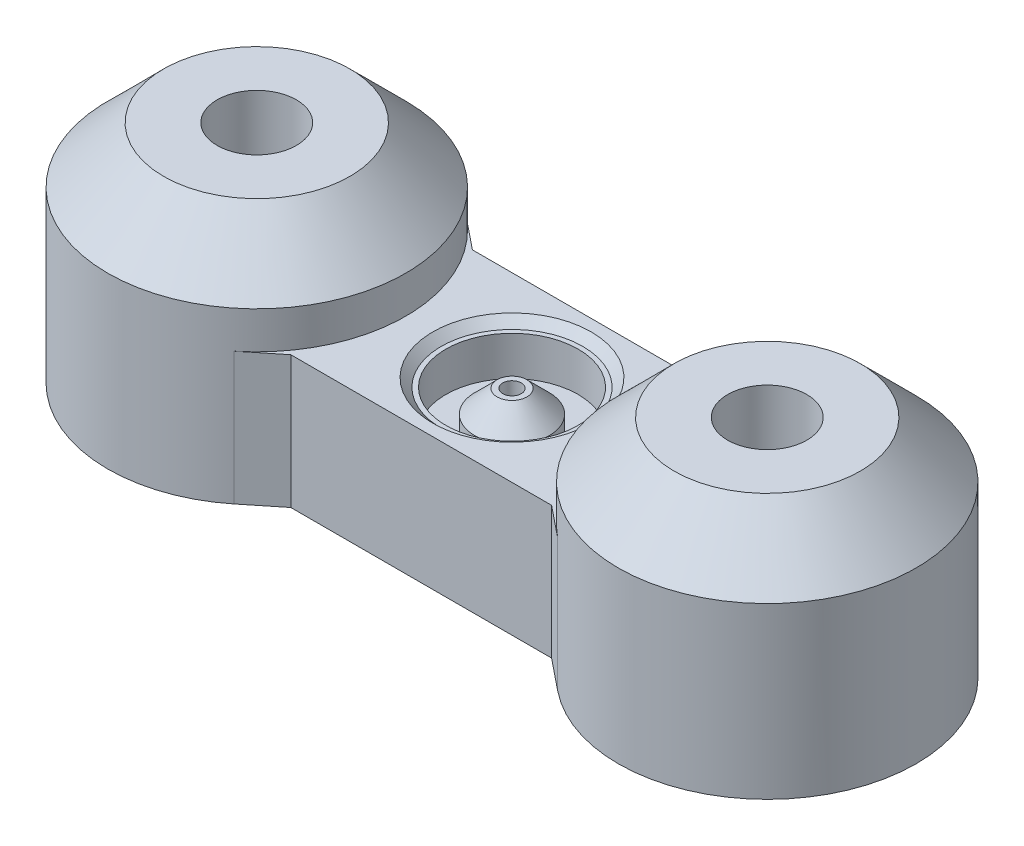
ISO-10303-21;
HEADER;
FILE_DESCRIPTION(('STEP AP214'),'2;1');
FILE_NAME('part.step','',(''),(''),'','','');
FILE_SCHEMA(('AUTOMOTIVE_DESIGN { 1 0 10303 214 1 1 1 1 }'));
ENDSEC;
DATA;
#1=APPLICATION_CONTEXT('core data for automotive mechanical design processes');
#2=APPLICATION_PROTOCOL_DEFINITION('international standard','automotive_design',2000,#1);
#3=PRODUCT_CONTEXT('',#1,'mechanical');
#4=PRODUCT('Part','Part','',(#3));
#5=PRODUCT_RELATED_PRODUCT_CATEGORY('part','',(#4));
#6=PRODUCT_DEFINITION_FORMATION('','',#4);
#7=PRODUCT_DEFINITION_CONTEXT('part definition',#1,'design');
#8=PRODUCT_DEFINITION('design','',#6,#7);
#9=PRODUCT_DEFINITION_SHAPE('','',#8);
#10=(LENGTH_UNIT() NAMED_UNIT(*) SI_UNIT(.MILLI.,.METRE.));
#11=(NAMED_UNIT(*) PLANE_ANGLE_UNIT() SI_UNIT($,.RADIAN.));
#12=(NAMED_UNIT(*) SI_UNIT($,.STERADIAN.) SOLID_ANGLE_UNIT());
#13=UNCERTAINTY_MEASURE_WITH_UNIT(LENGTH_MEASURE(1.E-05),#10,'distance_accuracy_value','');
#14=(GEOMETRIC_REPRESENTATION_CONTEXT(3) GLOBAL_UNCERTAINTY_ASSIGNED_CONTEXT((#13)) GLOBAL_UNIT_ASSIGNED_CONTEXT((#10,
#11,#12)) REPRESENTATION_CONTEXT('',''));
#15=CARTESIAN_POINT('',(0.,0.,0.));
#16=DIRECTION('',(0.,0.,1.));
#17=DIRECTION('',(1.,0.,0.));
#18=AXIS2_PLACEMENT_3D('',#15,#16,#17);
#19=CARTESIAN_POINT('',(0.,0.,0.));
#20=DIRECTION('',(0.,-1.,0.));
#21=DIRECTION('',(0.,0.,-1.));
#22=AXIS2_PLACEMENT_3D('',#19,#20,#21);
#23=PLANE('',#22);
#24=CARTESIAN_POINT('',(0.,0.,0.));
#25=DIRECTION('',(0.,-1.,0.));
#26=DIRECTION('',(0.,0.,-1.));
#27=AXIS2_PLACEMENT_3D('',#24,#25,#26);
#28=CIRCLE('',#27,4.25);
#29=CARTESIAN_POINT('',(0.,0.,-4.25));
#30=VERTEX_POINT('',#29);
#31=EDGE_CURVE('E223',#30,#30,#28,.T.);
#32=ORIENTED_EDGE('',*,*,#31,.T.);
#33=EDGE_LOOP('',(#32));
#34=FACE_BOUND('',#33,.T.);
#35=CARTESIAN_POINT('',(-13.7,0.,0.));
#36=DIRECTION('',(0.,1.,0.));
#37=DIRECTION('',(0.,0.,1.));
#38=AXIS2_PLACEMENT_3D('',#35,#36,#37);
#39=CIRCLE('',#38,8.00000000000001);
#40=CARTESIAN_POINT('',(-8.68001656430278,0.,6.22894584222126));
#41=VERTEX_POINT('',#40);
#42=CARTESIAN_POINT('',(-8.68001656430277,0.,-6.22894584222126));
#43=VERTEX_POINT('',#42);
#44=EDGE_CURVE('E146',#41,#43,#39,.T.);
#45=ORIENTED_EDGE('',*,*,#44,.F.);
#46=DIRECTION('',(0.778618230277657,0.,-0.627497929462154));
#47=VECTOR('',#46,1.);
#48=CARTESIAN_POINT('',(-7.,0.,4.875));
#49=LINE('',#48,#47);
#50=CARTESIAN_POINT('',(-7.,0.,4.875));
#51=VERTEX_POINT('',#50);
#52=EDGE_CURVE('E84',#41,#51,#49,.T.);
#53=ORIENTED_EDGE('',*,*,#52,.T.);
#54=DIRECTION('',(1.,0.,0.));
#55=VECTOR('',#54,1.);
#56=CARTESIAN_POINT('',(-7.,0.,4.875));
#57=LINE('',#56,#55);
#58=CARTESIAN_POINT('',(7.,0.,4.875));
#59=VERTEX_POINT('',#58);
#60=EDGE_CURVE('E81',#51,#59,#57,.T.);
#61=ORIENTED_EDGE('',*,*,#60,.T.);
#62=DIRECTION('',(0.778618230277656,0.,0.627497929462154));
#63=VECTOR('',#62,1.);
#64=CARTESIAN_POINT('',(7.,0.,4.875));
#65=LINE('',#64,#63);
#66=CARTESIAN_POINT('',(8.68001656430278,0.,6.22894584222126));
#67=VERTEX_POINT('',#66);
#68=EDGE_CURVE('E63',#59,#67,#65,.T.);
#69=ORIENTED_EDGE('',*,*,#68,.T.);
#70=CARTESIAN_POINT('',(13.7,0.,0.));
#71=DIRECTION('',(0.,1.,0.));
#72=DIRECTION('',(0.,0.,1.));
#73=AXIS2_PLACEMENT_3D('',#70,#71,#72);
#74=CIRCLE('',#73,8.);
#75=CARTESIAN_POINT('',(8.68001656430278,0.,-6.22894584222126));
#76=VERTEX_POINT('',#75);
#77=EDGE_CURVE('E122',#76,#67,#74,.T.);
#78=ORIENTED_EDGE('',*,*,#77,.F.);
#79=DIRECTION('',(-0.778618230277658,0.,0.627497929462152));
#80=VECTOR('',#79,1.);
#81=CARTESIAN_POINT('',(7.,0.,-4.875));
#82=LINE('',#81,#80);
#83=CARTESIAN_POINT('',(7.,0.,-4.875));
#84=VERTEX_POINT('',#83);
#85=EDGE_CURVE('E131',#76,#84,#82,.T.);
#86=ORIENTED_EDGE('',*,*,#85,.T.);
#87=DIRECTION('',(-1.,0.,0.));
#88=VECTOR('',#87,1.);
#89=CARTESIAN_POINT('',(7.,0.,-4.875));
#90=LINE('',#89,#88);
#91=CARTESIAN_POINT('',(-7.,0.,-4.875));
#92=VERTEX_POINT('',#91);
#93=EDGE_CURVE('E134',#84,#92,#90,.T.);
#94=ORIENTED_EDGE('',*,*,#93,.T.);
#95=DIRECTION('',(-0.778618230277657,0.,-0.627497929462154));
#96=VECTOR('',#95,1.);
#97=CARTESIAN_POINT('',(-7.,0.,-4.875));
#98=LINE('',#97,#96);
#99=EDGE_CURVE('E77',#92,#43,#98,.T.);
#100=ORIENTED_EDGE('',*,*,#99,.T.);
#101=EDGE_LOOP('',(#45,#53,#61,#69,#78,#86,#94,#100));
#102=FACE_BOUND('',#101,.T.);
#103=ADVANCED_FACE('F45',(#34,#102),#23,.F.);
#104=CARTESIAN_POINT('',(0.,-0.45,0.));
#105=DIRECTION('',(0.,1.,0.));
#106=DIRECTION('',(0.,0.,1.));
#107=AXIS2_PLACEMENT_3D('',#104,#105,#106);
#108=CONICAL_SURFACE('',#107,3.8,0.785398163397447);
#109=ORIENTED_EDGE('',*,*,#31,.F.);
#110=EDGE_LOOP('',(#109));
#111=FACE_BOUND('',#110,.T.);
#112=CARTESIAN_POINT('',(0.,-0.45,0.));
#113=DIRECTION('',(0.,-1.,0.));
#114=DIRECTION('',(0.,0.,-1.));
#115=AXIS2_PLACEMENT_3D('',#112,#113,#114);
#116=CIRCLE('',#115,3.8);
#117=CARTESIAN_POINT('',(0.,-0.45,-3.8));
#118=VERTEX_POINT('',#117);
#119=EDGE_CURVE('E150',#118,#118,#116,.T.);
#120=ORIENTED_EDGE('',*,*,#119,.T.);
#121=EDGE_LOOP('',(#120));
#122=FACE_BOUND('',#121,.T.);
#123=ADVANCED_FACE('F259',(#111,#122),#108,.F.);
#124=CARTESIAN_POINT('',(0.,-7.10337567297407,0.));
#125=DIRECTION('',(0.,-1.,0.));
#126=DIRECTION('',(0.,0.,-1.));
#127=AXIS2_PLACEMENT_3D('',#124,#125,#126);
#128=PLANE('',#127);
#129=CARTESIAN_POINT('',(-13.6999996482456,-7.10337567297407,0.));
#130=DIRECTION('',(0.,-1.,0.));
#131=DIRECTION('',(0.,0.,-1.));
#132=AXIS2_PLACEMENT_3D('',#129,#130,#131);
#133=CIRCLE('',#132,4.);
#134=CARTESIAN_POINT('',(-13.6999996482456,-7.10337567297407,-4.));
#135=VERTEX_POINT('',#134);
#136=EDGE_CURVE('E137',#135,#135,#133,.T.);
#137=ORIENTED_EDGE('',*,*,#136,.F.);
#138=EDGE_LOOP('',(#137));
#139=FACE_BOUND('',#138,.T.);
#140=CARTESIAN_POINT('',(13.7,-7.10337567297407,0.));
#141=DIRECTION('',(0.,-1.,0.));
#142=DIRECTION('',(0.,0.,-1.));
#143=AXIS2_PLACEMENT_3D('',#140,#141,#142);
#144=CIRCLE('',#143,4.);
#145=CARTESIAN_POINT('',(13.7,-7.10337567297407,-4.));
#146=VERTEX_POINT('',#145);
#147=EDGE_CURVE('E143',#146,#146,#144,.T.);
#148=ORIENTED_EDGE('',*,*,#147,.F.);
#149=EDGE_LOOP('',(#148));
#150=FACE_BOUND('',#149,.T.);
#151=CARTESIAN_POINT('',(0.,-7.10337567297407,0.));
#152=DIRECTION('',(0.,-1.,0.));
#153=DIRECTION('',(0.,0.,-1.));
#154=AXIS2_PLACEMENT_3D('',#151,#152,#153);
#155=CIRCLE('',#154,3.29903810567667);
#156=CARTESIAN_POINT('',(0.,-7.10337567297407,-3.29903810567667));
#157=VERTEX_POINT('',#156);
#158=EDGE_CURVE('E220',#157,#157,#155,.T.);
#159=ORIENTED_EDGE('',*,*,#158,.F.);
#160=EDGE_LOOP('',(#159));
#161=FACE_BOUND('',#160,.T.);
#162=DIRECTION('',(-0.778618230277656,0.,-0.627497929462154));
#163=VECTOR('',#162,1.);
#164=CARTESIAN_POINT('',(7.,-7.10337567297407,4.875));
#165=LINE('',#164,#163);
#166=CARTESIAN_POINT('',(8.68001656430278,-7.10337567297407,6.22894584222126));
#167=VERTEX_POINT('',#166);
#168=CARTESIAN_POINT('',(7.,-7.10337567297407,4.875));
#169=VERTEX_POINT('',#168);
#170=EDGE_CURVE('E155',#167,#169,#165,.T.);
#171=ORIENTED_EDGE('',*,*,#170,.T.);
#172=DIRECTION('',(-1.,0.,0.));
#173=VECTOR('',#172,1.);
#174=CARTESIAN_POINT('',(-7.,-7.10337567297407,4.875));
#175=LINE('',#174,#173);
#176=CARTESIAN_POINT('',(-7.,-7.10337567297407,4.875));
#177=VERTEX_POINT('',#176);
#178=EDGE_CURVE('E158',#169,#177,#175,.T.);
#179=ORIENTED_EDGE('',*,*,#178,.T.);
#180=DIRECTION('',(-0.778618230277657,0.,0.627497929462154));
#181=VECTOR('',#180,1.);
#182=CARTESIAN_POINT('',(-7.,-7.10337567297407,4.875));
#183=LINE('',#182,#181);
#184=CARTESIAN_POINT('',(-8.68001656430278,-7.10337567297407,6.22894584222126));
#185=VERTEX_POINT('',#184);
#186=EDGE_CURVE('E161',#177,#185,#183,.T.);
#187=ORIENTED_EDGE('',*,*,#186,.T.);
#188=CARTESIAN_POINT('',(-13.7,-7.10337567297407,0.));
#189=DIRECTION('',(0.,-1.,0.));
#190=DIRECTION('',(0.,0.,-1.));
#191=AXIS2_PLACEMENT_3D('',#188,#189,#190);
#192=CIRCLE('',#191,8.);
#193=CARTESIAN_POINT('',(-8.68001656430277,-7.10337567297407,-6.22894584222126));
#194=VERTEX_POINT('',#193);
#195=EDGE_CURVE('E164',#185,#194,#192,.T.);
#196=ORIENTED_EDGE('',*,*,#195,.T.);
#197=DIRECTION('',(0.778618230277657,0.,0.627497929462154));
#198=VECTOR('',#197,1.);
#199=CARTESIAN_POINT('',(-7.,-7.10337567297407,-4.875));
#200=LINE('',#199,#198);
#201=CARTESIAN_POINT('',(-7.,-7.10337567297407,-4.875));
#202=VERTEX_POINT('',#201);
#203=EDGE_CURVE('E167',#194,#202,#200,.T.);
#204=ORIENTED_EDGE('',*,*,#203,.T.);
#205=DIRECTION('',(1.,0.,0.));
#206=VECTOR('',#205,1.);
#207=CARTESIAN_POINT('',(7.,-7.10337567297407,-4.875));
#208=LINE('',#207,#206);
#209=CARTESIAN_POINT('',(7.,-7.10337567297407,-4.875));
#210=VERTEX_POINT('',#209);
#211=EDGE_CURVE('E170',#202,#210,#208,.T.);
#212=ORIENTED_EDGE('',*,*,#211,.T.);
#213=DIRECTION('',(0.778618230277658,0.,-0.627497929462152));
#214=VECTOR('',#213,1.);
#215=CARTESIAN_POINT('',(7.,-7.10337567297407,-4.875));
#216=LINE('',#215,#214);
#217=CARTESIAN_POINT('',(8.68001656430278,-7.10337567297407,-6.22894584222126));
#218=VERTEX_POINT('',#217);
#219=EDGE_CURVE('E173',#210,#218,#216,.T.);
#220=ORIENTED_EDGE('',*,*,#219,.T.);
#221=CARTESIAN_POINT('',(13.7,-7.10337567297407,0.));
#222=DIRECTION('',(0.,-1.,0.));
#223=DIRECTION('',(0.,0.,1.));
#224=AXIS2_PLACEMENT_3D('',#221,#222,#223);
#225=CIRCLE('',#224,8.);
#226=EDGE_CURVE('E124',#218,#167,#225,.T.);
#227=ORIENTED_EDGE('',*,*,#226,.T.);
#228=EDGE_LOOP('',(#171,#179,#187,#196,#204,#212,#220,#227));
#229=FACE_BOUND('',#228,.T.);
#230=ADVANCED_FACE('F267',(#139,#150,#161,#229),#128,.T.);
#231=CARTESIAN_POINT('',(0.,-7.10337567297407,0.));
#232=DIRECTION('',(0.,-1.,0.));
#233=DIRECTION('',(0.,0.,-1.));
#234=AXIS2_PLACEMENT_3D('',#231,#232,#233);
#235=CONICAL_SURFACE('',#234,3.29903810567667,1.0471975511966);
#236=CARTESIAN_POINT('',(0.,-6.35337567297407,0.));
#237=DIRECTION('',(0.,-1.,0.));
#238=DIRECTION('',(0.,0.,-1.));
#239=AXIS2_PLACEMENT_3D('',#236,#237,#238);
#240=CIRCLE('',#239,2.);
#241=CARTESIAN_POINT('',(0.,-6.35337567297407,-2.));
#242=VERTEX_POINT('',#241);
#243=EDGE_CURVE('E217',#242,#242,#240,.T.);
#244=ORIENTED_EDGE('',*,*,#243,.F.);
#245=EDGE_LOOP('',(#244));
#246=FACE_BOUND('',#245,.T.);
#247=ORIENTED_EDGE('',*,*,#158,.T.);
#248=EDGE_LOOP('',(#247));
#249=FACE_BOUND('',#248,.T.);
#250=ADVANCED_FACE('F347',(#246,#249),#235,.F.);
#251=CARTESIAN_POINT('',(0.,-6.35337567297407,0.));
#252=DIRECTION('',(0.,-1.,0.));
#253=DIRECTION('',(0.,0.,-1.));
#254=AXIS2_PLACEMENT_3D('',#251,#252,#253);
#255=PLANE('',#254);
#256=CARTESIAN_POINT('',(0.,-6.35337567297407,0.));
#257=DIRECTION('',(0.,-1.,0.));
#258=DIRECTION('',(0.,0.,-1.));
#259=AXIS2_PLACEMENT_3D('',#256,#257,#258);
#260=CIRCLE('',#259,3.);
#261=CARTESIAN_POINT('',(0.,-6.35337567297407,-3.));
#262=VERTEX_POINT('',#261);
#263=EDGE_CURVE('E214',#262,#262,#260,.T.);
#264=ORIENTED_EDGE('',*,*,#263,.F.);
#265=EDGE_LOOP('',(#264));
#266=FACE_BOUND('',#265,.T.);
#267=ORIENTED_EDGE('',*,*,#243,.T.);
#268=EDGE_LOOP('',(#267));
#269=FACE_BOUND('',#268,.T.);
#270=ADVANCED_FACE('F343',(#266,#269),#255,.F.);
#271=CARTESIAN_POINT('',(0.,0.,0.));
#272=DIRECTION('',(0.,-1.,0.));
#273=DIRECTION('',(0.,0.,-1.));
#274=AXIS2_PLACEMENT_3D('',#271,#272,#273);
#275=CYLINDRICAL_SURFACE('',#274,3.);
#276=CARTESIAN_POINT('',(0.,-5.00337567297407,0.));
#277=DIRECTION('',(0.,-1.,0.));
#278=DIRECTION('',(0.,0.,-1.));
#279=AXIS2_PLACEMENT_3D('',#276,#277,#278);
#280=CIRCLE('',#279,3.);
#281=CARTESIAN_POINT('',(0.,-5.00337567297407,-3.));
#282=VERTEX_POINT('',#281);
#283=EDGE_CURVE('E211',#282,#282,#280,.T.);
#284=ORIENTED_EDGE('',*,*,#283,.F.);
#285=EDGE_LOOP('',(#284));
#286=FACE_BOUND('',#285,.T.);
#287=ORIENTED_EDGE('',*,*,#263,.T.);
#288=EDGE_LOOP('',(#287));
#289=FACE_BOUND('',#288,.T.);
#290=ADVANCED_FACE('F339',(#286,#289),#275,.F.);
#291=CARTESIAN_POINT('',(0.,-5.00337567297407,0.));
#292=DIRECTION('',(0.,-1.,0.));
#293=DIRECTION('',(0.,0.,-1.));
#294=AXIS2_PLACEMENT_3D('',#291,#292,#293);
#295=CONICAL_SURFACE('',#294,3.,1.0471975511966);
#296=CARTESIAN_POINT('',(0.,-3.56,0.));
#297=DIRECTION('',(0.,-1.,0.));
#298=DIRECTION('',(0.,0.,-1.));
#299=AXIS2_PLACEMENT_3D('',#296,#297,#298);
#300=CIRCLE('',#299,0.499999999999999);
#301=CARTESIAN_POINT('',(0.,-3.56,-0.499999999999998));
#302=VERTEX_POINT('',#301);
#303=EDGE_CURVE('E208',#302,#302,#300,.T.);
#304=CARTESIAN_POINT('',(0.,-3.56,-0.499999999999998));
#305=CARTESIAN_POINT('',(0.,-3.57503516326015,-0.526041666666665));
#306=CARTESIAN_POINT('',(0.,-3.59007032652029,-0.552083333333331));
#307=CARTESIAN_POINT('',(0.,-3.62014065304059,-0.604166666666665));
#308=CARTESIAN_POINT('',(0.,-3.63517581630073,-0.630208333333331));
#309=CARTESIAN_POINT('',(0.,-3.66524614282103,-0.682291666666665));
#310=CARTESIAN_POINT('',(0.,-3.68028130608117,-0.708333333333331));
#311=CARTESIAN_POINT('',(0.,-3.71035163260146,-0.760416666666665));
#312=CARTESIAN_POINT('',(0.,-3.72538679586161,-0.786458333333331));
#313=CARTESIAN_POINT('',(0.,-3.7554571223819,-0.838541666666665));
#314=CARTESIAN_POINT('',(0.,-3.77049228564205,-0.864583333333331));
#315=CARTESIAN_POINT('',(0.,-3.80056261216234,-0.916666666666665));
#316=CARTESIAN_POINT('',(0.,-3.81559777542249,-0.942708333333332));
#317=CARTESIAN_POINT('',(0.,-3.84566810194278,-0.994791666666665));
#318=CARTESIAN_POINT('',(0.,-3.86070326520293,-1.02083333333333));
#319=CARTESIAN_POINT('',(0.,-3.89077359172322,-1.07291666666666));
#320=CARTESIAN_POINT('',(0.,-3.90580875498337,-1.09895833333333));
#321=CARTESIAN_POINT('',(0.,-3.93587908150366,-1.15104166666666));
#322=CARTESIAN_POINT('',(0.,-3.95091424476381,-1.17708333333333));
#323=CARTESIAN_POINT('',(0.,-3.9809845712841,-1.22916666666666));
#324=CARTESIAN_POINT('',(0.,-3.99601973454425,-1.25520833333333));
#325=CARTESIAN_POINT('',(0.,-4.02609006106454,-1.30729166666667));
#326=CARTESIAN_POINT('',(0.,-4.04112522432469,-1.33333333333333));
#327=CARTESIAN_POINT('',(0.,-4.07119555084498,-1.38541666666666));
#328=CARTESIAN_POINT('',(0.,-4.08623071410513,-1.41145833333333));
#329=CARTESIAN_POINT('',(0.,-4.11630104062542,-1.46354166666667));
#330=CARTESIAN_POINT('',(0.,-4.13133620388557,-1.48958333333333));
#331=CARTESIAN_POINT('',(0.,-4.16140653040586,-1.54166666666667));
#332=CARTESIAN_POINT('',(0.,-4.17644169366601,-1.56770833333333));
#333=CARTESIAN_POINT('',(0.,-4.2065120201863,-1.61979166666667));
#334=CARTESIAN_POINT('',(0.,-4.22154718344645,-1.64583333333333));
#335=CARTESIAN_POINT('',(0.,-4.25161750996674,-1.69791666666667));
#336=CARTESIAN_POINT('',(0.,-4.26665267322689,-1.72395833333333));
#337=CARTESIAN_POINT('',(0.,-4.29672299974718,-1.77604166666667));
#338=CARTESIAN_POINT('',(0.,-4.31175816300733,-1.80208333333333));
#339=CARTESIAN_POINT('',(0.,-4.34182848952762,-1.85416666666667));
#340=CARTESIAN_POINT('',(0.,-4.35686365278777,-1.88020833333333));
#341=CARTESIAN_POINT('',(0.,-4.38693397930806,-1.93229166666667));
#342=CARTESIAN_POINT('',(0.,-4.40196914256821,-1.95833333333333));
#343=CARTESIAN_POINT('',(0.,-4.4320394690885,-2.01041666666667));
#344=CARTESIAN_POINT('',(0.,-4.44707463234865,-2.03645833333333));
#345=CARTESIAN_POINT('',(0.,-4.47714495886894,-2.08854166666667));
#346=CARTESIAN_POINT('',(0.,-4.49218012212909,-2.11458333333333));
#347=CARTESIAN_POINT('',(0.,-4.52225044864938,-2.16666666666667));
#348=CARTESIAN_POINT('',(0.,-4.53728561190953,-2.19270833333333));
#349=CARTESIAN_POINT('',(0.,-4.56735593842982,-2.24479166666667));
#350=CARTESIAN_POINT('',(0.,-4.58239110168997,-2.27083333333333));
#351=CARTESIAN_POINT('',(0.,-4.61246142821026,-2.32291666666667));
#352=CARTESIAN_POINT('',(0.,-4.6274965914704,-2.34895833333333));
#353=CARTESIAN_POINT('',(0.,-4.6575669179907,-2.40104166666667));
#354=CARTESIAN_POINT('',(0.,-4.67260208125084,-2.42708333333333));
#355=CARTESIAN_POINT('',(0.,-4.70267240777114,-2.47916666666667));
#356=CARTESIAN_POINT('',(0.,-4.71770757103128,-2.50520833333333));
#357=CARTESIAN_POINT('',(0.,-4.74777789755158,-2.55729166666667));
#358=CARTESIAN_POINT('',(0.,-4.76281306081172,-2.58333333333333));
#359=CARTESIAN_POINT('',(0.,-4.79288338733202,-2.63541666666667));
#360=CARTESIAN_POINT('',(0.,-4.80791855059216,-2.66145833333333));
#361=CARTESIAN_POINT('',(0.,-4.83798887711246,-2.71354166666667));
#362=CARTESIAN_POINT('',(0.,-4.8530240403726,-2.73958333333333));
#363=CARTESIAN_POINT('',(0.,-4.8830943668929,-2.79166666666667));
#364=CARTESIAN_POINT('',(0.,-4.89812953015304,-2.81770833333333));
#365=CARTESIAN_POINT('',(0.,-4.92819985667334,-2.86979166666667));
#366=CARTESIAN_POINT('',(0.,-4.94323501993348,-2.89583333333333));
#367=CARTESIAN_POINT('',(0.,-4.97330534645378,-2.94791666666667));
#368=CARTESIAN_POINT('',(0.,-4.98834050971392,-2.97395833333333));
#369=CARTESIAN_POINT('',(0.,-5.00337567297407,-3.));
#370=B_SPLINE_CURVE_WITH_KNOTS('',3,(#304,#305,#306,#307,#308,#309,#310,#311,#312,#313,#314,
#315,#316,#317,#318,#319,#320,#321,#322,#323,#324,#325,#326,#327,#328,#329,#330,#331,#332,#333,
#334,#335,#336,#337,#338,#339,#340,#341,#342,#343,#344,#345,#346,#347,#348,#349,#350,#351,#352,
#353,#354,#355,#356,#357,#358,#359,#360,#361,#362,#363,#364,#365,#366,#367,#368,#369),
.UNSPECIFIED.,.F.,.F.,(4,2,2,2,2,2,2,2,2,2,2,2,2,2,2,2,2,2,2,2,2,2,2,2,2,2,2,2,2,2,2,2,4),(0.,
0.0902109795608793,0.180421959121758,0.270632938682637,0.360843918243517,0.451054897804396,
0.541265877365275,0.631476856926154,0.721687836487033,0.811898816047912,0.902109795608791,
0.992320775169671,1.08253175473055,1.17274273429143,1.26295371385231,1.35316469341319,
1.44337567297407,1.53358665253495,1.62379763209583,1.7140086116567,1.80421959121758,
1.89443057077846,1.98464155033934,2.07485252990022,2.1650635094611,2.25527448902198,
2.34548546858286,2.43569644814374,2.52590742770462,2.6161184072655,2.70632938682637,
2.79654036638725,2.88675134594813),.UNSPECIFIED.);
#371=EDGE_CURVE('BSEAM335',#302,#282,#370,.T.);
#372=ORIENTED_EDGE('',*,*,#303,.F.);
#373=ORIENTED_EDGE('',*,*,#283,.T.);
#374=ORIENTED_EDGE('',*,*,#371,.T.);
#375=ORIENTED_EDGE('',*,*,#371,.F.);
#376=EDGE_LOOP('',(#372,#374,#373,#375));
#377=FACE_BOUND('',#376,.T.);
#378=ADVANCED_FACE('F335',(#377),#295,.F.);
#379=CARTESIAN_POINT('',(0.,0.,0.));
#380=DIRECTION('',(0.,-1.,0.));
#381=DIRECTION('',(0.,0.,-1.));
#382=AXIS2_PLACEMENT_3D('',#379,#380,#381);
#383=CYLINDRICAL_SURFACE('',#382,0.5);
#384=CARTESIAN_POINT('',(0.,-0.5,0.));
#385=DIRECTION('',(0.,-1.,0.));
#386=DIRECTION('',(0.,0.,-1.));
#387=AXIS2_PLACEMENT_3D('',#384,#385,#386);
#388=CIRCLE('',#387,0.5);
#389=CARTESIAN_POINT('',(0.,-0.5,-0.5));
#390=VERTEX_POINT('',#389);
#391=EDGE_CURVE('E205',#390,#390,#388,.T.);
#392=ORIENTED_EDGE('',*,*,#391,.F.);
#393=EDGE_LOOP('',(#392));
#394=FACE_BOUND('',#393,.T.);
#395=ORIENTED_EDGE('',*,*,#303,.T.);
#396=EDGE_LOOP('',(#395));
#397=FACE_BOUND('',#396,.T.);
#398=ADVANCED_FACE('F331',(#394,#397),#383,.F.);
#399=CARTESIAN_POINT('',(0.,-0.5,0.));
#400=DIRECTION('',(0.,-1.,0.));
#401=DIRECTION('',(0.,0.,-1.));
#402=AXIS2_PLACEMENT_3D('',#399,#400,#401);
#403=PLANE('',#402);
#404=CARTESIAN_POINT('',(0.,-0.5,0.));
#405=DIRECTION('',(0.,-1.,0.));
#406=DIRECTION('',(0.,0.,-1.));
#407=AXIS2_PLACEMENT_3D('',#404,#405,#406);
#408=CIRCLE('',#407,0.8);
#409=CARTESIAN_POINT('',(0.,-0.5,-0.8));
#410=VERTEX_POINT('',#409);
#411=EDGE_CURVE('E202',#410,#410,#408,.T.);
#412=ORIENTED_EDGE('',*,*,#411,.F.);
#413=EDGE_LOOP('',(#412));
#414=FACE_BOUND('',#413,.T.);
#415=ORIENTED_EDGE('',*,*,#391,.T.);
#416=EDGE_LOOP('',(#415));
#417=FACE_BOUND('',#416,.T.);
#418=ADVANCED_FACE('F327',(#414,#417),#403,.F.);
#419=CARTESIAN_POINT('',(0.,-0.5,0.));
#420=DIRECTION('',(0.,-1.,0.));
#421=DIRECTION('',(0.,0.,-1.));
#422=AXIS2_PLACEMENT_3D('',#419,#420,#421);
#423=CONICAL_SURFACE('',#422,0.8,0.78539816339745);
#424=CARTESIAN_POINT('',(0.,-1.7,0.));
#425=DIRECTION('',(0.,-1.,0.));
#426=DIRECTION('',(0.,0.,-1.));
#427=AXIS2_PLACEMENT_3D('',#424,#425,#426);
#428=CIRCLE('',#427,2.);
#429=CARTESIAN_POINT('',(0.,-1.7,-2.));
#430=VERTEX_POINT('',#429);
#431=EDGE_CURVE('E199',#430,#430,#428,.T.);
#432=ORIENTED_EDGE('',*,*,#431,.F.);
#433=EDGE_LOOP('',(#432));
#434=FACE_BOUND('',#433,.T.);
#435=ORIENTED_EDGE('',*,*,#411,.T.);
#436=EDGE_LOOP('',(#435));
#437=FACE_BOUND('',#436,.T.);
#438=ADVANCED_FACE('F323',(#434,#437),#423,.T.);
#439=CARTESIAN_POINT('',(0.,0.,0.));
#440=DIRECTION('',(0.,-1.,0.));
#441=DIRECTION('',(0.,0.,-1.));
#442=AXIS2_PLACEMENT_3D('',#439,#440,#441);
#443=CYLINDRICAL_SURFACE('',#442,2.);
#444=CARTESIAN_POINT('',(0.,-2.56,0.));
#445=DIRECTION('',(0.,-1.,0.));
#446=DIRECTION('',(0.,0.,-1.));
#447=AXIS2_PLACEMENT_3D('',#444,#445,#446);
#448=CIRCLE('',#447,2.);
#449=CARTESIAN_POINT('',(0.,-2.56,-2.));
#450=VERTEX_POINT('',#449);
#451=EDGE_CURVE('E196',#450,#450,#448,.T.);
#452=ORIENTED_EDGE('',*,*,#451,.F.);
#453=EDGE_LOOP('',(#452));
#454=FACE_BOUND('',#453,.T.);
#455=ORIENTED_EDGE('',*,*,#431,.T.);
#456=EDGE_LOOP('',(#455));
#457=FACE_BOUND('',#456,.T.);
#458=ADVANCED_FACE('F319',(#454,#457),#443,.T.);
#459=CARTESIAN_POINT('',(0.,-2.56,0.));
#460=DIRECTION('',(0.,-1.,0.));
#461=DIRECTION('',(0.,0.,-1.));
#462=AXIS2_PLACEMENT_3D('',#459,#460,#461);
#463=PLANE('',#462);
#464=CARTESIAN_POINT('',(0.,-2.56,0.));
#465=DIRECTION('',(0.,-1.,0.));
#466=DIRECTION('',(0.,0.,-1.));
#467=AXIS2_PLACEMENT_3D('',#464,#465,#466);
#468=CIRCLE('',#467,3.55);
#469=CARTESIAN_POINT('',(0.,-2.56,-3.55));
#470=VERTEX_POINT('',#469);
#471=EDGE_CURVE('E193',#470,#470,#468,.T.);
#472=ORIENTED_EDGE('',*,*,#471,.F.);
#473=EDGE_LOOP('',(#472));
#474=FACE_BOUND('',#473,.T.);
#475=ORIENTED_EDGE('',*,*,#451,.T.);
#476=EDGE_LOOP('',(#475));
#477=FACE_BOUND('',#476,.T.);
#478=ADVANCED_FACE('F315',(#474,#477),#463,.F.);
#479=CARTESIAN_POINT('',(0.,0.,0.));
#480=DIRECTION('',(0.,-1.,0.));
#481=DIRECTION('',(0.,0.,-1.));
#482=AXIS2_PLACEMENT_3D('',#479,#480,#481);
#483=CYLINDRICAL_SURFACE('',#482,3.55);
#484=CARTESIAN_POINT('',(0.,-0.45,0.));
#485=DIRECTION('',(0.,-1.,0.));
#486=DIRECTION('',(0.,0.,-1.));
#487=AXIS2_PLACEMENT_3D('',#484,#485,#486);
#488=CIRCLE('',#487,3.55);
#489=CARTESIAN_POINT('',(0.,-0.45,-3.55));
#490=VERTEX_POINT('',#489);
#491=EDGE_CURVE('E190',#490,#490,#488,.T.);
#492=ORIENTED_EDGE('',*,*,#491,.F.);
#493=EDGE_LOOP('',(#492));
#494=FACE_BOUND('',#493,.T.);
#495=ORIENTED_EDGE('',*,*,#471,.T.);
#496=EDGE_LOOP('',(#495));
#497=FACE_BOUND('',#496,.T.);
#498=ADVANCED_FACE('F311',(#494,#497),#483,.F.);
#499=CARTESIAN_POINT('',(0.,-0.45,0.));
#500=DIRECTION('',(0.,-1.,0.));
#501=DIRECTION('',(0.,0.,-1.));
#502=AXIS2_PLACEMENT_3D('',#499,#500,#501);
#503=PLANE('',#502);
#504=ORIENTED_EDGE('',*,*,#119,.F.);
#505=EDGE_LOOP('',(#504));
#506=FACE_BOUND('',#505,.T.);
#507=ORIENTED_EDGE('',*,*,#491,.T.);
#508=EDGE_LOOP('',(#507));
#509=FACE_BOUND('',#508,.T.);
#510=ADVANCED_FACE('F304',(#506,#509),#503,.F.);
#511=CARTESIAN_POINT('',(-7.,46.2553780656909,4.875));
#512=DIRECTION('',(0.,0.,1.));
#513=DIRECTION('',(1.,0.,0.));
#514=AXIS2_PLACEMENT_3D('',#511,#512,#513);
#515=PLANE('',#514);
#516=ORIENTED_EDGE('',*,*,#60,.F.);
#517=DIRECTION('',(0.,-1.,0.));
#518=VECTOR('',#517,1.);
#519=CARTESIAN_POINT('',(-7.,46.2553780656909,4.875));
#520=LINE('',#519,#518);
#521=EDGE_CURVE('E185',#51,#177,#520,.T.);
#522=ORIENTED_EDGE('',*,*,#521,.T.);
#523=ORIENTED_EDGE('',*,*,#178,.F.);
#524=DIRECTION('',(0.,-1.,0.));
#525=VECTOR('',#524,1.);
#526=CARTESIAN_POINT('',(7.,46.2553780656909,4.875));
#527=LINE('',#526,#525);
#528=EDGE_CURVE('E176',#59,#169,#527,.T.);
#529=ORIENTED_EDGE('',*,*,#528,.F.);
#530=EDGE_LOOP('',(#516,#522,#523,#529));
#531=FACE_BOUND('',#530,.T.);
#532=ADVANCED_FACE('F300',(#531),#515,.T.);
#533=CARTESIAN_POINT('',(-7.,46.2553780656909,4.875));
#534=DIRECTION('',(0.627497929462154,0.,0.778618230277657));
#535=DIRECTION('',(0.778618230277657,0.,-0.627497929462154));
#536=AXIS2_PLACEMENT_3D('',#533,#534,#535);
#537=PLANE('',#536);
#538=ORIENTED_EDGE('',*,*,#52,.F.);
#539=DIRECTION('',(0.,-1.,0.));
#540=VECTOR('',#539,1.);
#541=CARTESIAN_POINT('',(-8.68001656430278,46.2553780656909,6.22894584222126));
#542=LINE('',#541,#540);
#543=EDGE_CURVE('E183',#41,#185,#542,.T.);
#544=ORIENTED_EDGE('',*,*,#543,.T.);
#545=ORIENTED_EDGE('',*,*,#186,.F.);
#546=ORIENTED_EDGE('',*,*,#521,.F.);
#547=EDGE_LOOP('',(#538,#544,#545,#546));
#548=FACE_BOUND('',#547,.T.);
#549=ADVANCED_FACE('F296',(#548),#537,.T.);
#550=CARTESIAN_POINT('',(-13.7,46.2553780656909,0.));
#551=DIRECTION('',(0.,-1.,0.));
#552=DIRECTION('',(0.,0.,-1.));
#553=AXIS2_PLACEMENT_3D('',#550,#551,#552);
#554=CYLINDRICAL_SURFACE('',#553,8.);
#555=CARTESIAN_POINT('',(-13.7,2.,0.));
#556=DIRECTION('',(0.,1.,0.));
#557=DIRECTION('',(0.,0.,1.));
#558=AXIS2_PLACEMENT_3D('',#555,#556,#557);
#559=CIRCLE('',#558,8.);
#560=CARTESIAN_POINT('',(-13.7,2.,8.));
#561=VERTEX_POINT('',#560);
#562=EDGE_CURVE('E241',#561,#561,#559,.F.);
#563=ORIENTED_EDGE('',*,*,#562,.T.);
#564=EDGE_LOOP('',(#563));
#565=FACE_BOUND('',#564,.T.);
#566=ORIENTED_EDGE('',*,*,#543,.F.);
#567=ORIENTED_EDGE('',*,*,#44,.T.);
#568=DIRECTION('',(0.,-1.,0.));
#569=VECTOR('',#568,1.);
#570=CARTESIAN_POINT('',(-8.68001656430277,46.2553780656909,-6.22894584222126));
#571=LINE('',#570,#569);
#572=EDGE_CURVE('E181',#43,#194,#571,.T.);
#573=ORIENTED_EDGE('',*,*,#572,.T.);
#574=ORIENTED_EDGE('',*,*,#195,.F.);
#575=EDGE_LOOP('',(#566,#567,#573,#574));
#576=FACE_BOUND('',#575,.T.);
#577=ADVANCED_FACE('F292',(#565,#576),#554,.T.);
#578=CARTESIAN_POINT('',(-7.,46.2553780656909,-4.875));
#579=DIRECTION('',(0.627497929462154,0.,-0.778618230277657));
#580=DIRECTION('',(-0.778618230277657,0.,-0.627497929462154));
#581=AXIS2_PLACEMENT_3D('',#578,#579,#580);
#582=PLANE('',#581);
#583=ORIENTED_EDGE('',*,*,#99,.F.);
#584=DIRECTION('',(0.,-1.,0.));
#585=VECTOR('',#584,1.);
#586=CARTESIAN_POINT('',(-7.,46.2553780656909,-4.875));
#587=LINE('',#586,#585);
#588=EDGE_CURVE('E179',#92,#202,#587,.T.);
#589=ORIENTED_EDGE('',*,*,#588,.T.);
#590=ORIENTED_EDGE('',*,*,#203,.F.);
#591=ORIENTED_EDGE('',*,*,#572,.F.);
#592=EDGE_LOOP('',(#583,#589,#590,#591));
#593=FACE_BOUND('',#592,.T.);
#594=ADVANCED_FACE('F289',(#593),#582,.T.);
#595=CARTESIAN_POINT('',(7.,46.2553780656909,-4.875));
#596=DIRECTION('',(0.,0.,-1.));
#597=DIRECTION('',(-1.,0.,0.));
#598=AXIS2_PLACEMENT_3D('',#595,#596,#597);
#599=PLANE('',#598);
#600=ORIENTED_EDGE('',*,*,#93,.F.);
#601=DIRECTION('',(0.,-1.,0.));
#602=VECTOR('',#601,1.);
#603=CARTESIAN_POINT('',(7.,46.2553780656909,-4.875));
#604=LINE('',#603,#602);
#605=EDGE_CURVE('E128',#84,#210,#604,.T.);
#606=ORIENTED_EDGE('',*,*,#605,.T.);
#607=ORIENTED_EDGE('',*,*,#211,.F.);
#608=ORIENTED_EDGE('',*,*,#588,.F.);
#609=EDGE_LOOP('',(#600,#606,#607,#608));
#610=FACE_BOUND('',#609,.T.);
#611=ADVANCED_FACE('F286',(#610),#599,.T.);
#612=CARTESIAN_POINT('',(7.,46.2553780656909,-4.875));
#613=DIRECTION('',(-0.627497929462152,0.,-0.778618230277658));
#614=DIRECTION('',(-0.778618230277658,0.,0.627497929462152));
#615=AXIS2_PLACEMENT_3D('',#612,#613,#614);
#616=PLANE('',#615);
#617=ORIENTED_EDGE('',*,*,#85,.F.);
#618=DIRECTION('',(0.,-1.,0.));
#619=VECTOR('',#618,1.);
#620=CARTESIAN_POINT('',(8.68001656430278,46.2553780656909,-6.22894584222126));
#621=LINE('',#620,#619);
#622=EDGE_CURVE('E119',#76,#218,#621,.T.);
#623=ORIENTED_EDGE('',*,*,#622,.T.);
#624=ORIENTED_EDGE('',*,*,#219,.F.);
#625=ORIENTED_EDGE('',*,*,#605,.F.);
#626=EDGE_LOOP('',(#617,#623,#624,#625));
#627=FACE_BOUND('',#626,.T.);
#628=ADVANCED_FACE('F132',(#627),#616,.T.);
#629=CARTESIAN_POINT('',(13.7,46.2553780656909,0.));
#630=DIRECTION('',(0.,-1.,0.));
#631=DIRECTION('',(0.,0.,-1.));
#632=AXIS2_PLACEMENT_3D('',#629,#630,#631);
#633=CYLINDRICAL_SURFACE('',#632,8.);
#634=CARTESIAN_POINT('',(13.7,2.,0.));
#635=DIRECTION('',(0.,1.,0.));
#636=DIRECTION('',(0.,0.,1.));
#637=AXIS2_PLACEMENT_3D('',#634,#635,#636);
#638=CIRCLE('',#637,8.);
#639=CARTESIAN_POINT('',(13.7,2.,8.));
#640=VERTEX_POINT('',#639);
#641=EDGE_CURVE('E12',#640,#640,#638,.F.);
#642=ORIENTED_EDGE('',*,*,#641,.T.);
#643=EDGE_LOOP('',(#642));
#644=FACE_BOUND('',#643,.T.);
#645=ORIENTED_EDGE('',*,*,#622,.F.);
#646=ORIENTED_EDGE('',*,*,#77,.T.);
#647=DIRECTION('',(0.,-1.,0.));
#648=VECTOR('',#647,1.);
#649=CARTESIAN_POINT('',(8.68001656430278,46.2553780656909,6.22894584222126));
#650=LINE('',#649,#648);
#651=EDGE_CURVE('E91',#67,#167,#650,.T.);
#652=ORIENTED_EDGE('',*,*,#651,.T.);
#653=ORIENTED_EDGE('',*,*,#226,.F.);
#654=EDGE_LOOP('',(#645,#646,#652,#653));
#655=FACE_BOUND('',#654,.T.);
#656=ADVANCED_FACE('F121',(#644,#655),#633,.T.);
#657=CARTESIAN_POINT('',(7.,46.2553780656909,4.875));
#658=DIRECTION('',(-0.627497929462154,0.,0.778618230277656));
#659=DIRECTION('',(0.778618230277656,0.,0.627497929462154));
#660=AXIS2_PLACEMENT_3D('',#657,#658,#659);
#661=PLANE('',#660);
#662=ORIENTED_EDGE('',*,*,#68,.F.);
#663=ORIENTED_EDGE('',*,*,#528,.T.);
#664=ORIENTED_EDGE('',*,*,#170,.F.);
#665=ORIENTED_EDGE('',*,*,#651,.F.);
#666=EDGE_LOOP('',(#662,#663,#664,#665));
#667=FACE_BOUND('',#666,.T.);
#668=ADVANCED_FACE('F280',(#667),#661,.T.);
#669=CARTESIAN_POINT('',(13.7,46.2553780656909,0.));
#670=DIRECTION('',(0.,-1.,0.));
#671=DIRECTION('',(0.,0.,-1.));
#672=AXIS2_PLACEMENT_3D('',#669,#670,#671);
#673=CYLINDRICAL_SURFACE('',#672,2.125);
#674=CARTESIAN_POINT('',(13.7,1.92783121635129,0.));
#675=DIRECTION('',(0.,-1.,0.));
#676=DIRECTION('',(0.,0.,-1.));
#677=AXIS2_PLACEMENT_3D('',#674,#675,#676);
#678=CIRCLE('',#677,2.125);
#679=CARTESIAN_POINT('',(13.7,1.92783121635129,-2.125));
#680=VERTEX_POINT('',#679);
#681=EDGE_CURVE('E232',#680,#680,#678,.T.);
#682=ORIENTED_EDGE('',*,*,#681,.T.);
#683=EDGE_LOOP('',(#682));
#684=FACE_BOUND('',#683,.T.);
#685=CARTESIAN_POINT('',(13.7,5.,0.));
#686=DIRECTION('',(0.,1.,0.));
#687=DIRECTION('',(0.,0.,1.));
#688=AXIS2_PLACEMENT_3D('',#685,#686,#687);
#689=CIRCLE('',#688,2.125);
#690=CARTESIAN_POINT('',(13.7,5.,2.125));
#691=VERTEX_POINT('',#690);
#692=EDGE_CURVE('E136',#691,#691,#689,.T.);
#693=ORIENTED_EDGE('',*,*,#692,.T.);
#694=EDGE_LOOP('',(#693));
#695=FACE_BOUND('',#694,.T.);
#696=ADVANCED_FACE('F276',(#684,#695),#673,.F.);
#697=CARTESIAN_POINT('',(-13.7,46.2553780656909,0.));
#698=DIRECTION('',(0.,-1.,0.));
#699=DIRECTION('',(0.,0.,-1.));
#700=AXIS2_PLACEMENT_3D('',#697,#698,#699);
#701=CYLINDRICAL_SURFACE('',#700,2.125);
#702=CARTESIAN_POINT('',(-13.6999996482456,1.92783121635129,0.));
#703=DIRECTION('',(0.,-1.,0.));
#704=DIRECTION('',(0.,0.,-1.));
#705=AXIS2_PLACEMENT_3D('',#702,#703,#704);
#706=CIRCLE('',#705,2.125);
#707=CARTESIAN_POINT('',(-13.6999996482456,1.92783121635129,-2.125));
#708=VERTEX_POINT('',#707);
#709=EDGE_CURVE('E235',#708,#708,#706,.T.);
#710=ORIENTED_EDGE('',*,*,#709,.T.);
#711=EDGE_LOOP('',(#710));
#712=FACE_BOUND('',#711,.T.);
#713=CARTESIAN_POINT('',(-13.7,5.,0.));
#714=DIRECTION('',(0.,1.,0.));
#715=DIRECTION('',(0.,0.,1.));
#716=AXIS2_PLACEMENT_3D('',#713,#714,#715);
#717=CIRCLE('',#716,2.125);
#718=CARTESIAN_POINT('',(-13.7,5.,2.125));
#719=VERTEX_POINT('',#718);
#720=EDGE_CURVE('E140',#719,#719,#717,.T.);
#721=ORIENTED_EDGE('',*,*,#720,.T.);
#722=EDGE_LOOP('',(#721));
#723=FACE_BOUND('',#722,.T.);
#724=ADVANCED_FACE('F273',(#712,#723),#701,.F.);
#725=CARTESIAN_POINT('',(13.7,5.,0.));
#726=DIRECTION('',(0.,1.,0.));
#727=DIRECTION('',(0.,0.,1.));
#728=AXIS2_PLACEMENT_3D('',#725,#726,#727);
#729=PLANE('',#728);
#730=CARTESIAN_POINT('',(13.7,5.,0.));
#731=DIRECTION('',(0.,1.,0.));
#732=DIRECTION('',(0.,0.,1.));
#733=AXIS2_PLACEMENT_3D('',#730,#731,#732);
#734=CIRCLE('',#733,5.00000000000001);
#735=CARTESIAN_POINT('',(13.7,5.,5.00000000000001));
#736=VERTEX_POINT('',#735);
#737=EDGE_CURVE('E55',#736,#736,#734,.T.);
#738=ORIENTED_EDGE('',*,*,#737,.T.);
#739=EDGE_LOOP('',(#738));
#740=FACE_BOUND('',#739,.T.);
#741=ORIENTED_EDGE('',*,*,#692,.F.);
#742=EDGE_LOOP('',(#741));
#743=FACE_BOUND('',#742,.T.);
#744=ADVANCED_FACE('F246',(#740,#743),#729,.T.);
#745=CARTESIAN_POINT('',(-13.7,5.,0.));
#746=DIRECTION('',(0.,1.,0.));
#747=DIRECTION('',(0.,0.,1.));
#748=AXIS2_PLACEMENT_3D('',#745,#746,#747);
#749=PLANE('',#748);
#750=CARTESIAN_POINT('',(-13.7,5.,0.));
#751=DIRECTION('',(0.,1.,0.));
#752=DIRECTION('',(0.,0.,1.));
#753=AXIS2_PLACEMENT_3D('',#750,#751,#752);
#754=CIRCLE('',#753,5.00000000000001);
#755=CARTESIAN_POINT('',(-13.7,5.,5.));
#756=VERTEX_POINT('',#755);
#757=EDGE_CURVE('E238',#756,#756,#754,.T.);
#758=ORIENTED_EDGE('',*,*,#757,.T.);
#759=EDGE_LOOP('',(#758));
#760=FACE_BOUND('',#759,.T.);
#761=ORIENTED_EDGE('',*,*,#720,.F.);
#762=EDGE_LOOP('',(#761));
#763=FACE_BOUND('',#762,.T.);
#764=ADVANCED_FACE('F407',(#760,#763),#749,.T.);
#765=CARTESIAN_POINT('',(-13.6999996482456,16.3137084989848,0.));
#766=DIRECTION('',(0.,-1.,0.));
#767=DIRECTION('',(0.,0.,-1.));
#768=AXIS2_PLACEMENT_3D('',#765,#766,#767);
#769=CYLINDRICAL_SURFACE('',#768,4.);
#770=CARTESIAN_POINT('',(-13.6999996482456,0.845299461620727,0.));
#771=DIRECTION('',(0.,1.,0.));
#772=DIRECTION('',(0.,0.,1.));
#773=AXIS2_PLACEMENT_3D('',#770,#771,#772);
#774=CIRCLE('',#773,4.);
#775=CARTESIAN_POINT('',(-13.6999996482456,0.845299461620727,4.));
#776=VERTEX_POINT('',#775);
#777=EDGE_CURVE('E229',#776,#776,#774,.T.);
#778=ORIENTED_EDGE('',*,*,#777,.T.);
#779=EDGE_LOOP('',(#778));
#780=FACE_BOUND('',#779,.T.);
#781=ORIENTED_EDGE('',*,*,#136,.T.);
#782=EDGE_LOOP('',(#781));
#783=FACE_BOUND('',#782,.T.);
#784=ADVANCED_FACE('F401',(#780,#783),#769,.F.);
#785=CARTESIAN_POINT('',(13.7,16.3137084989848,0.));
#786=DIRECTION('',(0.,-1.,0.));
#787=DIRECTION('',(0.,0.,-1.));
#788=AXIS2_PLACEMENT_3D('',#785,#786,#787);
#789=CYLINDRICAL_SURFACE('',#788,4.);
#790=CARTESIAN_POINT('',(13.7,0.845299461620727,0.));
#791=DIRECTION('',(0.,1.,0.));
#792=DIRECTION('',(0.,0.,1.));
#793=AXIS2_PLACEMENT_3D('',#790,#791,#792);
#794=CIRCLE('',#793,4.);
#795=CARTESIAN_POINT('',(13.7,0.845299461620727,4.));
#796=VERTEX_POINT('',#795);
#797=EDGE_CURVE('E226',#796,#796,#794,.T.);
#798=ORIENTED_EDGE('',*,*,#797,.T.);
#799=EDGE_LOOP('',(#798));
#800=FACE_BOUND('',#799,.T.);
#801=ORIENTED_EDGE('',*,*,#147,.T.);
#802=EDGE_LOOP('',(#801));
#803=FACE_BOUND('',#802,.T.);
#804=ADVANCED_FACE('F362',(#800,#803),#789,.F.);
#805=CARTESIAN_POINT('',(13.7,2.,0.));
#806=DIRECTION('',(0.,-1.,0.));
#807=DIRECTION('',(0.,0.,-1.));
#808=AXIS2_PLACEMENT_3D('',#805,#806,#807);
#809=CONICAL_SURFACE('',#808,1.99999999999999,1.04719755119659);
#810=ORIENTED_EDGE('',*,*,#797,.F.);
#811=EDGE_LOOP('',(#810));
#812=FACE_BOUND('',#811,.T.);
#813=ORIENTED_EDGE('',*,*,#681,.F.);
#814=EDGE_LOOP('',(#813));
#815=FACE_BOUND('',#814,.T.);
#816=ADVANCED_FACE('F356',(#812,#815),#809,.F.);
#817=CARTESIAN_POINT('',(-13.6999996482456,2.,0.));
#818=DIRECTION('',(0.,-1.,0.));
#819=DIRECTION('',(0.,0.,-1.));
#820=AXIS2_PLACEMENT_3D('',#817,#818,#819);
#821=CONICAL_SURFACE('',#820,1.99999999999999,1.04719755119659);
#822=ORIENTED_EDGE('',*,*,#777,.F.);
#823=EDGE_LOOP('',(#822));
#824=FACE_BOUND('',#823,.T.);
#825=ORIENTED_EDGE('',*,*,#709,.F.);
#826=EDGE_LOOP('',(#825));
#827=FACE_BOUND('',#826,.T.);
#828=ADVANCED_FACE('F255',(#824,#827),#821,.F.);
#829=CARTESIAN_POINT('',(-13.7,5.,0.));
#830=DIRECTION('',(0.,-1.,0.));
#831=DIRECTION('',(0.,0.,-1.));
#832=AXIS2_PLACEMENT_3D('',#829,#830,#831);
#833=CONICAL_SURFACE('',#832,5.00000000000001,0.785398163397448);
#834=ORIENTED_EDGE('',*,*,#562,.F.);
#835=EDGE_LOOP('',(#834));
#836=FACE_BOUND('',#835,.T.);
#837=ORIENTED_EDGE('',*,*,#757,.F.);
#838=EDGE_LOOP('',(#837));
#839=FACE_BOUND('',#838,.T.);
#840=ADVANCED_FACE('F250',(#836,#839),#833,.T.);
#841=CARTESIAN_POINT('',(13.7,5.,0.));
#842=DIRECTION('',(0.,-1.,0.));
#843=DIRECTION('',(0.,0.,-1.));
#844=AXIS2_PLACEMENT_3D('',#841,#842,#843);
#845=CONICAL_SURFACE('',#844,5.00000000000001,0.785398163397447);
#846=ORIENTED_EDGE('',*,*,#641,.F.);
#847=EDGE_LOOP('',(#846));
#848=FACE_BOUND('',#847,.T.);
#849=ORIENTED_EDGE('',*,*,#737,.F.);
#850=EDGE_LOOP('',(#849));
#851=FACE_BOUND('',#850,.T.);
#852=ADVANCED_FACE('F48',(#848,#851),#845,.T.);
#853=CLOSED_SHELL('',(#103,#123,#230,#250,#270,#290,#378,#398,#418,#438,#458,#478,#498,#510,
#532,#549,#577,#594,#611,#628,#656,#668,#696,#724,#744,#764,#784,#804,#816,#828,#840,#852));
#854=MANIFOLD_SOLID_BREP('B2',#853);
#855=ADVANCED_BREP_SHAPE_REPRESENTATION('',(#18,#854),#14);
#856=SHAPE_DEFINITION_REPRESENTATION(#9,#855);
ENDSEC;
END-ISO-10303-21;
